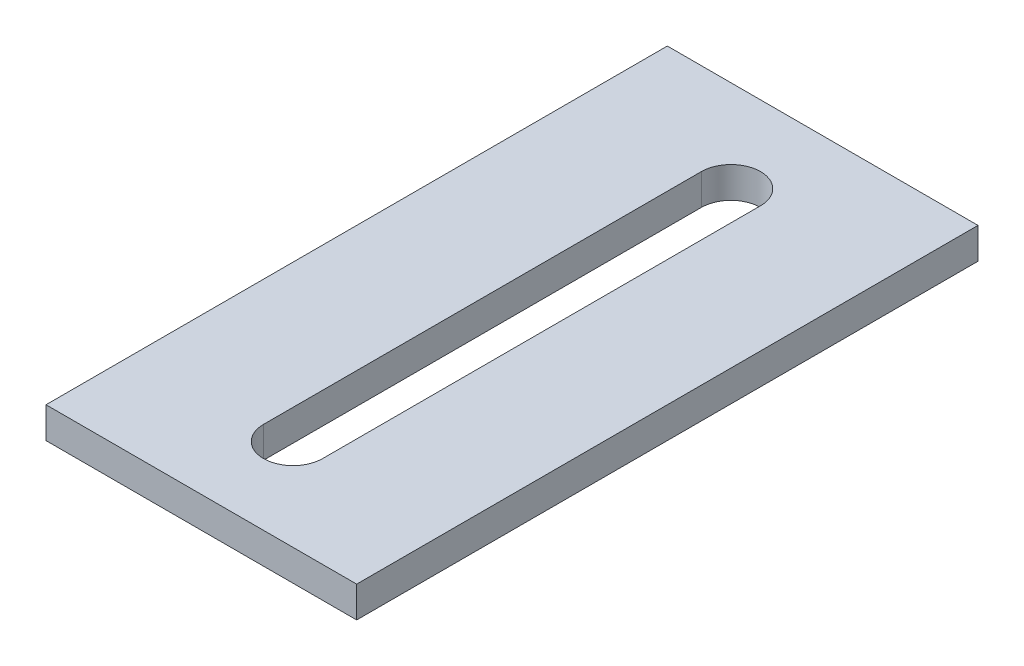
ISO-10303-21;
HEADER;
FILE_DESCRIPTION(('STEP AP214'),'2;1');
FILE_NAME('part.step','',(''),(''),'','','');
FILE_SCHEMA(('AUTOMOTIVE_DESIGN { 1 0 10303 214 1 1 1 1 }'));
ENDSEC;
DATA;
#1=APPLICATION_CONTEXT('core data for automotive mechanical design processes');
#2=APPLICATION_PROTOCOL_DEFINITION('international standard','automotive_design',2000,#1);
#3=PRODUCT_CONTEXT('',#1,'mechanical');
#4=PRODUCT('Part','Part','',(#3));
#5=PRODUCT_RELATED_PRODUCT_CATEGORY('part','',(#4));
#6=PRODUCT_DEFINITION_FORMATION('','',#4);
#7=PRODUCT_DEFINITION_CONTEXT('part definition',#1,'design');
#8=PRODUCT_DEFINITION('design','',#6,#7);
#9=PRODUCT_DEFINITION_SHAPE('','',#8);
#10=(LENGTH_UNIT() NAMED_UNIT(*) SI_UNIT(.MILLI.,.METRE.));
#11=(NAMED_UNIT(*) PLANE_ANGLE_UNIT() SI_UNIT($,.RADIAN.));
#12=(NAMED_UNIT(*) SI_UNIT($,.STERADIAN.) SOLID_ANGLE_UNIT());
#13=UNCERTAINTY_MEASURE_WITH_UNIT(LENGTH_MEASURE(1.E-05),#10,'distance_accuracy_value','');
#14=(GEOMETRIC_REPRESENTATION_CONTEXT(3) GLOBAL_UNCERTAINTY_ASSIGNED_CONTEXT((#13)) GLOBAL_UNIT_ASSIGNED_CONTEXT((#10,
#11,#12)) REPRESENTATION_CONTEXT('',''));
#15=CARTESIAN_POINT('',(0.,0.,0.));
#16=DIRECTION('',(0.,0.,1.));
#17=DIRECTION('',(1.,0.,0.));
#18=AXIS2_PLACEMENT_3D('',#15,#16,#17);
#19=CARTESIAN_POINT('',(25.,-2.5,-50.));
#20=DIRECTION('',(1.,0.,0.));
#21=DIRECTION('',(0.,0.,-1.));
#22=AXIS2_PLACEMENT_3D('',#19,#20,#21);
#23=PLANE('',#22);
#24=DIRECTION('',(0.,1.,0.));
#25=VECTOR('',#24,1.);
#26=CARTESIAN_POINT('',(25.,-2.5,-50.));
#27=LINE('',#26,#25);
#28=CARTESIAN_POINT('',(25.,-2.5,-50.));
#29=VERTEX_POINT('',#28);
#30=CARTESIAN_POINT('',(25.,2.5,-50.));
#31=VERTEX_POINT('',#30);
#32=EDGE_CURVE('E42',#29,#31,#27,.T.);
#33=ORIENTED_EDGE('',*,*,#32,.T.);
#34=DIRECTION('',(0.,0.,-1.));
#35=VECTOR('',#34,1.);
#36=CARTESIAN_POINT('',(25.,2.5,-50.));
#37=LINE('',#36,#35);
#38=CARTESIAN_POINT('',(25.,2.5,50.));
#39=VERTEX_POINT('',#38);
#40=EDGE_CURVE('E134',#39,#31,#37,.T.);
#41=ORIENTED_EDGE('',*,*,#40,.F.);
#42=DIRECTION('',(0.,1.,0.));
#43=VECTOR('',#42,1.);
#44=CARTESIAN_POINT('',(25.,-2.5,50.));
#45=LINE('',#44,#43);
#46=CARTESIAN_POINT('',(25.,-2.5,50.));
#47=VERTEX_POINT('',#46);
#48=EDGE_CURVE('E11',#47,#39,#45,.T.);
#49=ORIENTED_EDGE('',*,*,#48,.F.);
#50=DIRECTION('',(0.,0.,-1.));
#51=VECTOR('',#50,1.);
#52=CARTESIAN_POINT('',(25.,-2.5,-50.));
#53=LINE('',#52,#51);
#54=EDGE_CURVE('E153',#47,#29,#53,.T.);
#55=ORIENTED_EDGE('',*,*,#54,.T.);
#56=EDGE_LOOP('',(#33,#41,#49,#55));
#57=FACE_BOUND('',#56,.T.);
#58=ADVANCED_FACE('F39',(#57),#23,.T.);
#59=CARTESIAN_POINT('',(-25.,-2.5,50.));
#60=DIRECTION('',(0.,0.,1.));
#61=DIRECTION('',(1.,0.,0.));
#62=AXIS2_PLACEMENT_3D('',#59,#60,#61);
#63=PLANE('',#62);
#64=ORIENTED_EDGE('',*,*,#48,.T.);
#65=DIRECTION('',(1.,0.,0.));
#66=VECTOR('',#65,1.);
#67=CARTESIAN_POINT('',(-25.,2.5,50.));
#68=LINE('',#67,#66);
#69=CARTESIAN_POINT('',(-25.,2.5,50.));
#70=VERTEX_POINT('',#69);
#71=EDGE_CURVE('E143',#70,#39,#68,.T.);
#72=ORIENTED_EDGE('',*,*,#71,.F.);
#73=DIRECTION('',(0.,1.,0.));
#74=VECTOR('',#73,1.);
#75=CARTESIAN_POINT('',(-25.,-2.5,50.));
#76=LINE('',#75,#74);
#77=CARTESIAN_POINT('',(-25.,-2.5,50.));
#78=VERTEX_POINT('',#77);
#79=EDGE_CURVE('E47',#78,#70,#76,.T.);
#80=ORIENTED_EDGE('',*,*,#79,.F.);
#81=DIRECTION('',(1.,0.,0.));
#82=VECTOR('',#81,1.);
#83=CARTESIAN_POINT('',(-25.,-2.5,50.));
#84=LINE('',#83,#82);
#85=EDGE_CURVE('E164',#78,#47,#84,.T.);
#86=ORIENTED_EDGE('',*,*,#85,.T.);
#87=EDGE_LOOP('',(#64,#72,#80,#86));
#88=FACE_BOUND('',#87,.T.);
#89=ADVANCED_FACE('F176',(#88),#63,.T.);
#90=CARTESIAN_POINT('',(-25.,-2.5,-50.));
#91=DIRECTION('',(-1.,0.,0.));
#92=DIRECTION('',(0.,0.,1.));
#93=AXIS2_PLACEMENT_3D('',#90,#91,#92);
#94=PLANE('',#93);
#95=ORIENTED_EDGE('',*,*,#79,.T.);
#96=DIRECTION('',(0.,0.,1.));
#97=VECTOR('',#96,1.);
#98=CARTESIAN_POINT('',(-25.,2.5,-50.));
#99=LINE('',#98,#97);
#100=CARTESIAN_POINT('',(-25.,2.5,-50.));
#101=VERTEX_POINT('',#100);
#102=EDGE_CURVE('E140',#101,#70,#99,.T.);
#103=ORIENTED_EDGE('',*,*,#102,.F.);
#104=DIRECTION('',(0.,1.,0.));
#105=VECTOR('',#104,1.);
#106=CARTESIAN_POINT('',(-25.,-2.5,-50.));
#107=LINE('',#106,#105);
#108=CARTESIAN_POINT('',(-25.,-2.5,-50.));
#109=VERTEX_POINT('',#108);
#110=EDGE_CURVE('E167',#109,#101,#107,.T.);
#111=ORIENTED_EDGE('',*,*,#110,.F.);
#112=DIRECTION('',(0.,0.,1.));
#113=VECTOR('',#112,1.);
#114=CARTESIAN_POINT('',(-25.,-2.5,-50.));
#115=LINE('',#114,#113);
#116=EDGE_CURVE('E161',#109,#78,#115,.T.);
#117=ORIENTED_EDGE('',*,*,#116,.T.);
#118=EDGE_LOOP('',(#95,#103,#111,#117));
#119=FACE_BOUND('',#118,.T.);
#120=ADVANCED_FACE('F182',(#119),#94,.T.);
#121=CARTESIAN_POINT('',(-25.,-2.5,-50.));
#122=DIRECTION('',(0.,0.,-1.));
#123=DIRECTION('',(-1.,0.,0.));
#124=AXIS2_PLACEMENT_3D('',#121,#122,#123);
#125=PLANE('',#124);
#126=ORIENTED_EDGE('',*,*,#110,.T.);
#127=DIRECTION('',(-1.,0.,0.));
#128=VECTOR('',#127,1.);
#129=CARTESIAN_POINT('',(-25.,2.5,-50.));
#130=LINE('',#129,#128);
#131=EDGE_CURVE('E137',#31,#101,#130,.T.);
#132=ORIENTED_EDGE('',*,*,#131,.F.);
#133=ORIENTED_EDGE('',*,*,#32,.F.);
#134=DIRECTION('',(-1.,0.,0.));
#135=VECTOR('',#134,1.);
#136=CARTESIAN_POINT('',(-25.,-2.5,-50.));
#137=LINE('',#136,#135);
#138=EDGE_CURVE('E158',#29,#109,#137,.T.);
#139=ORIENTED_EDGE('',*,*,#138,.T.);
#140=EDGE_LOOP('',(#126,#132,#133,#139));
#141=FACE_BOUND('',#140,.T.);
#142=ADVANCED_FACE('F171',(#141),#125,.T.);
#143=CARTESIAN_POINT('',(0.,-2.5,0.));
#144=DIRECTION('',(0.,1.,0.));
#145=DIRECTION('',(0.,0.,1.));
#146=AXIS2_PLACEMENT_3D('',#143,#144,#145);
#147=PLANE('',#146);
#148=DIRECTION('',(0.,0.,-1.));
#149=VECTOR('',#148,1.);
#150=CARTESIAN_POINT('',(4.7625,-2.5,-35.2375));
#151=LINE('',#150,#149);
#152=CARTESIAN_POINT('',(4.76250000000001,-2.5,35.2375));
#153=VERTEX_POINT('',#152);
#154=CARTESIAN_POINT('',(4.7625,-2.5,-35.2375));
#155=VERTEX_POINT('',#154);
#156=EDGE_CURVE('E116',#153,#155,#151,.T.);
#157=ORIENTED_EDGE('',*,*,#156,.T.);
#158=CARTESIAN_POINT('',(0.,-2.5,-35.2375));
#159=DIRECTION('',(0.,1.,0.));
#160=DIRECTION('',(0.,0.,1.));
#161=AXIS2_PLACEMENT_3D('',#158,#159,#160);
#162=CIRCLE('',#161,4.7625);
#163=CARTESIAN_POINT('',(-4.7625,-2.5,-35.2375));
#164=VERTEX_POINT('',#163);
#165=EDGE_CURVE('E146',#155,#164,#162,.T.);
#166=ORIENTED_EDGE('',*,*,#165,.T.);
#167=DIRECTION('',(0.,0.,1.));
#168=VECTOR('',#167,1.);
#169=CARTESIAN_POINT('',(-4.7625,-2.5,-35.2375));
#170=LINE('',#169,#168);
#171=CARTESIAN_POINT('',(-4.76249999999999,-2.5,35.2375));
#172=VERTEX_POINT('',#171);
#173=EDGE_CURVE('E111',#164,#172,#170,.T.);
#174=ORIENTED_EDGE('',*,*,#173,.T.);
#175=CARTESIAN_POINT('',(0.,-2.5,35.2375));
#176=DIRECTION('',(0.,1.,0.));
#177=DIRECTION('',(0.,0.,1.));
#178=AXIS2_PLACEMENT_3D('',#175,#176,#177);
#179=CIRCLE('',#178,4.7625);
#180=EDGE_CURVE('E55',#172,#153,#179,.T.);
#181=ORIENTED_EDGE('',*,*,#180,.T.);
#182=EDGE_LOOP('',(#157,#166,#174,#181));
#183=FACE_BOUND('',#182,.T.);
#184=ORIENTED_EDGE('',*,*,#54,.F.);
#185=ORIENTED_EDGE('',*,*,#85,.F.);
#186=ORIENTED_EDGE('',*,*,#116,.F.);
#187=ORIENTED_EDGE('',*,*,#138,.F.);
#188=EDGE_LOOP('',(#184,#185,#186,#187));
#189=FACE_BOUND('',#188,.T.);
#190=ADVANCED_FACE('F180',(#183,#189),#147,.F.);
#191=CARTESIAN_POINT('',(0.,-2.5,-35.2375));
#192=DIRECTION('',(0.,1.,0.));
#193=DIRECTION('',(0.,0.,1.));
#194=AXIS2_PLACEMENT_3D('',#191,#192,#193);
#195=CYLINDRICAL_SURFACE('',#194,4.7625);
#196=DIRECTION('',(0.,1.,0.));
#197=VECTOR('',#196,1.);
#198=CARTESIAN_POINT('',(4.7625,-2.5,-35.2375));
#199=LINE('',#198,#197);
#200=CARTESIAN_POINT('',(4.7625,2.5,-35.2375));
#201=VERTEX_POINT('',#200);
#202=EDGE_CURVE('E121',#155,#201,#199,.T.);
#203=ORIENTED_EDGE('',*,*,#202,.T.);
#204=CARTESIAN_POINT('',(0.,2.5,-35.2375));
#205=DIRECTION('',(0.,1.,0.));
#206=DIRECTION('',(0.,0.,1.));
#207=AXIS2_PLACEMENT_3D('',#204,#205,#206);
#208=CIRCLE('',#207,4.7625);
#209=CARTESIAN_POINT('',(-4.7625,2.5,-35.2375));
#210=VERTEX_POINT('',#209);
#211=EDGE_CURVE('E119',#201,#210,#208,.T.);
#212=ORIENTED_EDGE('',*,*,#211,.T.);
#213=DIRECTION('',(0.,1.,0.));
#214=VECTOR('',#213,1.);
#215=CARTESIAN_POINT('',(-4.7625,-2.5,-35.2375));
#216=LINE('',#215,#214);
#217=EDGE_CURVE('E104',#164,#210,#216,.T.);
#218=ORIENTED_EDGE('',*,*,#217,.F.);
#219=ORIENTED_EDGE('',*,*,#165,.F.);
#220=EDGE_LOOP('',(#203,#212,#218,#219));
#221=FACE_BOUND('',#220,.T.);
#222=ADVANCED_FACE('F120',(#221),#195,.F.);
#223=CARTESIAN_POINT('',(4.7625,-2.5,-35.2375));
#224=DIRECTION('',(1.,0.,0.));
#225=DIRECTION('',(0.,0.,-1.));
#226=AXIS2_PLACEMENT_3D('',#223,#224,#225);
#227=PLANE('',#226);
#228=DIRECTION('',(0.,1.,0.));
#229=VECTOR('',#228,1.);
#230=CARTESIAN_POINT('',(4.76250000000001,-2.5,35.2375));
#231=LINE('',#230,#229);
#232=CARTESIAN_POINT('',(4.76250000000001,2.5,35.2375));
#233=VERTEX_POINT('',#232);
#234=EDGE_CURVE('E154',#153,#233,#231,.T.);
#235=ORIENTED_EDGE('',*,*,#234,.T.);
#236=DIRECTION('',(0.,0.,-1.));
#237=VECTOR('',#236,1.);
#238=CARTESIAN_POINT('',(4.7625,2.5,-35.2375));
#239=LINE('',#238,#237);
#240=EDGE_CURVE('E130',#233,#201,#239,.T.);
#241=ORIENTED_EDGE('',*,*,#240,.T.);
#242=ORIENTED_EDGE('',*,*,#202,.F.);
#243=ORIENTED_EDGE('',*,*,#156,.F.);
#244=EDGE_LOOP('',(#235,#241,#242,#243));
#245=FACE_BOUND('',#244,.T.);
#246=ADVANCED_FACE('F229',(#245),#227,.F.);
#247=CARTESIAN_POINT('',(0.,-2.5,35.2375));
#248=DIRECTION('',(0.,1.,0.));
#249=DIRECTION('',(0.,0.,1.));
#250=AXIS2_PLACEMENT_3D('',#247,#248,#249);
#251=CYLINDRICAL_SURFACE('',#250,4.7625);
#252=DIRECTION('',(0.,1.,0.));
#253=VECTOR('',#252,1.);
#254=CARTESIAN_POINT('',(-4.76249999999999,-2.5,35.2375));
#255=LINE('',#254,#253);
#256=CARTESIAN_POINT('',(-4.76249999999999,2.5,35.2375));
#257=VERTEX_POINT('',#256);
#258=EDGE_CURVE('E115',#172,#257,#255,.T.);
#259=ORIENTED_EDGE('',*,*,#258,.T.);
#260=CARTESIAN_POINT('',(0.,2.5,35.2375));
#261=DIRECTION('',(0.,1.,0.));
#262=DIRECTION('',(0.,0.,1.));
#263=AXIS2_PLACEMENT_3D('',#260,#261,#262);
#264=CIRCLE('',#263,4.7625);
#265=EDGE_CURVE('E128',#257,#233,#264,.T.);
#266=ORIENTED_EDGE('',*,*,#265,.T.);
#267=ORIENTED_EDGE('',*,*,#234,.F.);
#268=ORIENTED_EDGE('',*,*,#180,.F.);
#269=EDGE_LOOP('',(#259,#266,#267,#268));
#270=FACE_BOUND('',#269,.T.);
#271=ADVANCED_FACE('F239',(#270),#251,.F.);
#272=CARTESIAN_POINT('',(-4.7625,-2.5,-35.2375));
#273=DIRECTION('',(-1.,0.,0.));
#274=DIRECTION('',(0.,0.,1.));
#275=AXIS2_PLACEMENT_3D('',#272,#273,#274);
#276=PLANE('',#275);
#277=ORIENTED_EDGE('',*,*,#217,.T.);
#278=DIRECTION('',(0.,0.,1.));
#279=VECTOR('',#278,1.);
#280=CARTESIAN_POINT('',(-4.7625,2.5,-35.2375));
#281=LINE('',#280,#279);
#282=EDGE_CURVE('E108',#210,#257,#281,.T.);
#283=ORIENTED_EDGE('',*,*,#282,.T.);
#284=ORIENTED_EDGE('',*,*,#258,.F.);
#285=ORIENTED_EDGE('',*,*,#173,.F.);
#286=EDGE_LOOP('',(#277,#283,#284,#285));
#287=FACE_BOUND('',#286,.T.);
#288=ADVANCED_FACE('F106',(#287),#276,.F.);
#289=CARTESIAN_POINT('',(0.,2.5,0.));
#290=DIRECTION('',(0.,1.,0.));
#291=DIRECTION('',(0.,0.,1.));
#292=AXIS2_PLACEMENT_3D('',#289,#290,#291);
#293=PLANE('',#292);
#294=ORIENTED_EDGE('',*,*,#40,.T.);
#295=ORIENTED_EDGE('',*,*,#131,.T.);
#296=ORIENTED_EDGE('',*,*,#102,.T.);
#297=ORIENTED_EDGE('',*,*,#71,.T.);
#298=EDGE_LOOP('',(#294,#295,#296,#297));
#299=FACE_BOUND('',#298,.T.);
#300=ORIENTED_EDGE('',*,*,#282,.F.);
#301=ORIENTED_EDGE('',*,*,#211,.F.);
#302=ORIENTED_EDGE('',*,*,#240,.F.);
#303=ORIENTED_EDGE('',*,*,#265,.F.);
#304=EDGE_LOOP('',(#300,#301,#302,#303));
#305=FACE_BOUND('',#304,.T.);
#306=ADVANCED_FACE('F126',(#299,#305),#293,.T.);
#307=CLOSED_SHELL('',(#58,#89,#120,#142,#190,#222,#246,#271,#288,#306));
#308=MANIFOLD_SOLID_BREP('B2',#307);
#309=ADVANCED_BREP_SHAPE_REPRESENTATION('',(#18,#308),#14);
#310=SHAPE_DEFINITION_REPRESENTATION(#9,#309);
ENDSEC;
END-ISO-10303-21;
